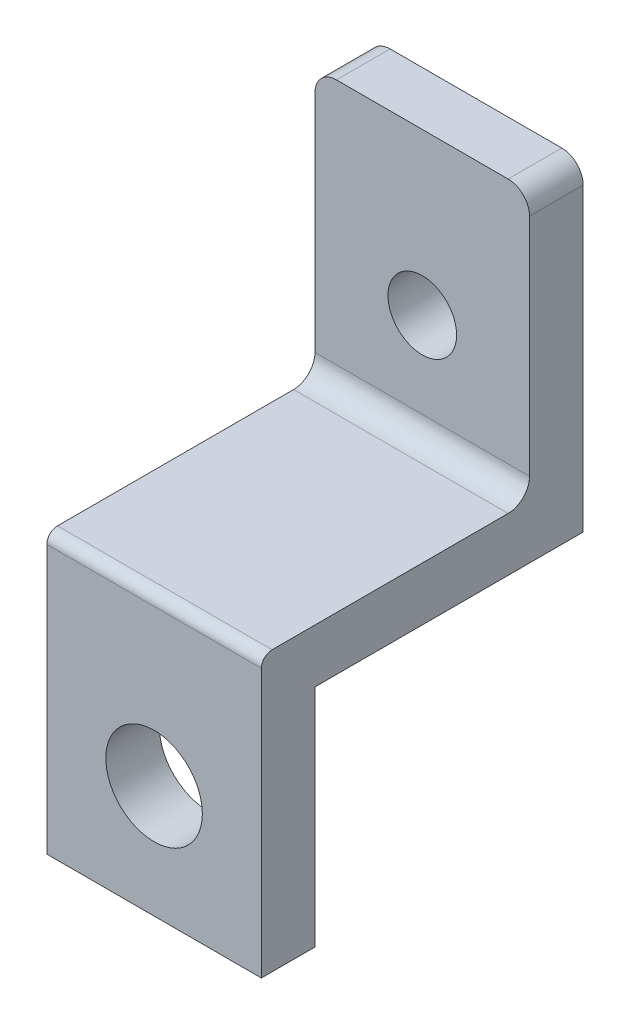
ISO-10303-21;
HEADER;
FILE_DESCRIPTION(('STEP AP214'),'2;1');
FILE_NAME('part.step','',(''),(''),'','','');
FILE_SCHEMA(('AUTOMOTIVE_DESIGN { 1 0 10303 214 1 1 1 1 }'));
ENDSEC;
DATA;
#1=APPLICATION_CONTEXT('core data for automotive mechanical design processes');
#2=APPLICATION_PROTOCOL_DEFINITION('international standard','automotive_design',2000,#1);
#3=PRODUCT_CONTEXT('',#1,'mechanical');
#4=PRODUCT('Part','Part','',(#3));
#5=PRODUCT_RELATED_PRODUCT_CATEGORY('part','',(#4));
#6=PRODUCT_DEFINITION_FORMATION('','',#4);
#7=PRODUCT_DEFINITION_CONTEXT('part definition',#1,'design');
#8=PRODUCT_DEFINITION('design','',#6,#7);
#9=PRODUCT_DEFINITION_SHAPE('','',#8);
#10=(LENGTH_UNIT() NAMED_UNIT(*) SI_UNIT(.MILLI.,.METRE.));
#11=(NAMED_UNIT(*) PLANE_ANGLE_UNIT() SI_UNIT($,.RADIAN.));
#12=(NAMED_UNIT(*) SI_UNIT($,.STERADIAN.) SOLID_ANGLE_UNIT());
#13=UNCERTAINTY_MEASURE_WITH_UNIT(LENGTH_MEASURE(1.E-05),#10,'distance_accuracy_value','');
#14=(GEOMETRIC_REPRESENTATION_CONTEXT(3) GLOBAL_UNCERTAINTY_ASSIGNED_CONTEXT((#13)) GLOBAL_UNIT_ASSIGNED_CONTEXT((#10,
#11,#12)) REPRESENTATION_CONTEXT('',''));
#15=CARTESIAN_POINT('',(0.,0.,0.));
#16=DIRECTION('',(0.,0.,1.));
#17=DIRECTION('',(1.,0.,0.));
#18=AXIS2_PLACEMENT_3D('',#15,#16,#17);
#19=CARTESIAN_POINT('',(0.,0.,0.));
#20=DIRECTION('',(0.,0.,1.));
#21=DIRECTION('',(1.,0.,0.));
#22=AXIS2_PLACEMENT_3D('',#19,#20,#21);
#23=PLANE('',#22);
#24=CARTESIAN_POINT('',(0.,-0.5,0.));
#25=DIRECTION('',(0.,0.,1.));
#26=DIRECTION('',(1.,0.,0.));
#27=AXIS2_PLACEMENT_3D('',#24,#25,#26);
#28=CIRCLE('',#27,4.5);
#29=CARTESIAN_POINT('',(4.5,-0.5,0.));
#30=VERTEX_POINT('',#29);
#31=EDGE_CURVE('E146',#30,#30,#28,.T.);
#32=ORIENTED_EDGE('',*,*,#31,.T.);
#33=EDGE_LOOP('',(#32));
#34=FACE_BOUND('',#33,.T.);
#35=DIRECTION('',(-1.,0.,0.));
#36=VECTOR('',#35,1.);
#37=CARTESIAN_POINT('',(10.,10.,0.));
#38=LINE('',#37,#36);
#39=CARTESIAN_POINT('',(10.,9.99999999999999,0.));
#40=VERTEX_POINT('',#39);
#41=CARTESIAN_POINT('',(-9.99999999999999,10.,0.));
#42=VERTEX_POINT('',#41);
#43=EDGE_CURVE('E155',#40,#42,#38,.T.);
#44=ORIENTED_EDGE('',*,*,#43,.F.);
#45=DIRECTION('',(0.,1.,0.));
#46=VECTOR('',#45,1.);
#47=CARTESIAN_POINT('',(10.,44.,0.));
#48=LINE('',#47,#46);
#49=CARTESIAN_POINT('',(10.,-11.,0.));
#50=VERTEX_POINT('',#49);
#51=EDGE_CURVE('E143',#50,#40,#48,.T.);
#52=ORIENTED_EDGE('',*,*,#51,.F.);
#53=DIRECTION('',(1.,0.,0.));
#54=VECTOR('',#53,1.);
#55=CARTESIAN_POINT('',(-10.,-11.,0.));
#56=LINE('',#55,#54);
#57=CARTESIAN_POINT('',(-10.,-11.,0.));
#58=VERTEX_POINT('',#57);
#59=EDGE_CURVE('E167',#58,#50,#56,.T.);
#60=ORIENTED_EDGE('',*,*,#59,.F.);
#61=DIRECTION('',(0.,-1.,0.));
#62=VECTOR('',#61,1.);
#63=CARTESIAN_POINT('',(-10.,-10.,0.));
#64=LINE('',#63,#62);
#65=EDGE_CURVE('E173',#42,#58,#64,.T.);
#66=ORIENTED_EDGE('',*,*,#65,.F.);
#67=EDGE_LOOP('',(#44,#52,#60,#66));
#68=FACE_BOUND('',#67,.T.);
#69=ADVANCED_FACE('F38',(#34,#68),#23,.F.);
#70=CARTESIAN_POINT('',(0.,0.,5.));
#71=DIRECTION('',(0.,0.,1.));
#72=DIRECTION('',(1.,0.,0.));
#73=AXIS2_PLACEMENT_3D('',#70,#71,#72);
#74=PLANE('',#73);
#75=DIRECTION('',(0.,1.,0.));
#76=VECTOR('',#75,1.);
#77=CARTESIAN_POINT('',(10.,-11.,5.));
#78=LINE('',#77,#76);
#79=CARTESIAN_POINT('',(10.,-11.,5.));
#80=VERTEX_POINT('',#79);
#81=CARTESIAN_POINT('',(10.,14.,5.));
#82=VERTEX_POINT('',#81);
#83=EDGE_CURVE('E163',#80,#82,#78,.T.);
#84=ORIENTED_EDGE('',*,*,#83,.T.);
#85=DIRECTION('',(1.,0.,0.));
#86=VECTOR('',#85,1.);
#87=CARTESIAN_POINT('',(-10.,14.,5.));
#88=LINE('',#87,#86);
#89=CARTESIAN_POINT('',(-10.,14.,5.));
#90=VERTEX_POINT('',#89);
#91=EDGE_CURVE('E199',#82,#90,#88,.F.);
#92=ORIENTED_EDGE('',*,*,#91,.T.);
#93=DIRECTION('',(0.,-1.,0.));
#94=VECTOR('',#93,1.);
#95=CARTESIAN_POINT('',(-10.,44.,5.));
#96=LINE('',#95,#94);
#97=CARTESIAN_POINT('',(-10.,-11.,5.));
#98=VERTEX_POINT('',#97);
#99=EDGE_CURVE('E166',#90,#98,#96,.T.);
#100=ORIENTED_EDGE('',*,*,#99,.T.);
#101=DIRECTION('',(1.,0.,0.));
#102=VECTOR('',#101,1.);
#103=CARTESIAN_POINT('',(-10.,-11.,5.));
#104=LINE('',#103,#102);
#105=EDGE_CURVE('E169',#98,#80,#104,.T.);
#106=ORIENTED_EDGE('',*,*,#105,.T.);
#107=EDGE_LOOP('',(#84,#92,#100,#106));
#108=FACE_BOUND('',#107,.T.);
#109=CARTESIAN_POINT('',(0.,-0.5,5.));
#110=DIRECTION('',(0.,0.,1.));
#111=DIRECTION('',(1.,0.,0.));
#112=AXIS2_PLACEMENT_3D('',#109,#110,#111);
#113=CIRCLE('',#112,4.5);
#114=CARTESIAN_POINT('',(4.5,-0.5,5.));
#115=VERTEX_POINT('',#114);
#116=EDGE_CURVE('E158',#115,#115,#113,.T.);
#117=ORIENTED_EDGE('',*,*,#116,.F.);
#118=EDGE_LOOP('',(#117));
#119=FACE_BOUND('',#118,.T.);
#120=ADVANCED_FACE('F262',(#108,#119),#74,.T.);
#121=CARTESIAN_POINT('',(10.,44.,5.));
#122=DIRECTION('',(-1.,0.,0.));
#123=DIRECTION('',(0.,-1.,0.));
#124=AXIS2_PLACEMENT_3D('',#121,#122,#123);
#125=PLANE('',#124);
#126=DIRECTION('',(0.,-1.,0.));
#127=VECTOR('',#126,1.);
#128=CARTESIAN_POINT('',(10.,49.,-25.));
#129=LINE('',#128,#127);
#130=CARTESIAN_POINT('',(10.,38.,-25.));
#131=VERTEX_POINT('',#130);
#132=CARTESIAN_POINT('',(10.,10.,-25.));
#133=VERTEX_POINT('',#132);
#134=EDGE_CURVE('E127',#131,#133,#129,.T.);
#135=ORIENTED_EDGE('',*,*,#134,.F.);
#136=DIRECTION('',(0.,0.,1.));
#137=VECTOR('',#136,1.);
#138=CARTESIAN_POINT('',(10.,38.,5.));
#139=LINE('',#138,#137);
#140=CARTESIAN_POINT('',(10.,38.,-20.));
#141=VERTEX_POINT('',#140);
#142=EDGE_CURVE('E11',#131,#141,#139,.T.);
#143=ORIENTED_EDGE('',*,*,#142,.T.);
#144=DIRECTION('',(0.,1.,0.));
#145=VECTOR('',#144,1.);
#146=CARTESIAN_POINT('',(10.,15.,-20.));
#147=LINE('',#146,#145);
#148=CARTESIAN_POINT('',(10.,17.,-20.));
#149=VERTEX_POINT('',#148);
#150=EDGE_CURVE('E235',#149,#141,#147,.T.);
#151=ORIENTED_EDGE('',*,*,#150,.F.);
#152=CARTESIAN_POINT('',(10.,17.,-18.));
#153=DIRECTION('',(-1.,0.,0.));
#154=DIRECTION('',(0.,-1.,0.));
#155=AXIS2_PLACEMENT_3D('',#152,#153,#154);
#156=CIRCLE('',#155,2.);
#157=CARTESIAN_POINT('',(10.,15.,-18.));
#158=VERTEX_POINT('',#157);
#159=EDGE_CURVE('E189',#149,#158,#156,.T.);
#160=ORIENTED_EDGE('',*,*,#159,.T.);
#161=DIRECTION('',(0.,0.,-1.));
#162=VECTOR('',#161,1.);
#163=CARTESIAN_POINT('',(10.,15.,0.));
#164=LINE('',#163,#162);
#165=CARTESIAN_POINT('',(10.,15.,4.));
#166=VERTEX_POINT('',#165);
#167=EDGE_CURVE('E233',#166,#158,#164,.T.);
#168=ORIENTED_EDGE('',*,*,#167,.F.);
#169=CARTESIAN_POINT('',(10.,14.,4.));
#170=DIRECTION('',(-1.,0.,0.));
#171=DIRECTION('',(0.,-1.,0.));
#172=AXIS2_PLACEMENT_3D('',#169,#170,#171);
#173=CIRCLE('',#172,1.);
#174=EDGE_CURVE('E197',#166,#82,#173,.F.);
#175=ORIENTED_EDGE('',*,*,#174,.T.);
#176=ORIENTED_EDGE('',*,*,#83,.F.);
#177=DIRECTION('',(0.,0.,-1.));
#178=VECTOR('',#177,1.);
#179=CARTESIAN_POINT('',(10.,-11.,5.));
#180=LINE('',#179,#178);
#181=EDGE_CURVE('E171',#80,#50,#180,.T.);
#182=ORIENTED_EDGE('',*,*,#181,.T.);
#183=ORIENTED_EDGE('',*,*,#51,.T.);
#184=DIRECTION('',(0.,0.,1.));
#185=VECTOR('',#184,1.);
#186=CARTESIAN_POINT('',(10.,10.,-25.));
#187=LINE('',#186,#185);
#188=EDGE_CURVE('E140',#133,#40,#187,.T.);
#189=ORIENTED_EDGE('',*,*,#188,.F.);
#190=EDGE_LOOP('',(#135,#143,#151,#160,#168,#175,#176,#182,#183,#189));
#191=FACE_BOUND('',#190,.T.);
#192=ADVANCED_FACE('F141',(#191),#125,.F.);
#193=CARTESIAN_POINT('',(-10.,-10.,5.));
#194=DIRECTION('',(1.,0.,0.));
#195=DIRECTION('',(0.,0.,-1.));
#196=AXIS2_PLACEMENT_3D('',#193,#194,#195);
#197=PLANE('',#196);
#198=DIRECTION('',(0.,1.,0.));
#199=VECTOR('',#198,1.);
#200=CARTESIAN_POINT('',(-10.,-10.,-20.));
#201=LINE('',#200,#199);
#202=CARTESIAN_POINT('',(-10.,17.,-20.));
#203=VERTEX_POINT('',#202);
#204=CARTESIAN_POINT('',(-10.,38.,-20.));
#205=VERTEX_POINT('',#204);
#206=EDGE_CURVE('E156',#203,#205,#201,.T.);
#207=ORIENTED_EDGE('',*,*,#206,.T.);
#208=DIRECTION('',(0.,0.,1.));
#209=VECTOR('',#208,1.);
#210=CARTESIAN_POINT('',(-10.,38.,5.));
#211=LINE('',#210,#209);
#212=CARTESIAN_POINT('',(-9.99999999999999,38.,-25.));
#213=VERTEX_POINT('',#212);
#214=EDGE_CURVE('E61',#205,#213,#211,.F.);
#215=ORIENTED_EDGE('',*,*,#214,.T.);
#216=DIRECTION('',(0.,1.,0.));
#217=VECTOR('',#216,1.);
#218=CARTESIAN_POINT('',(-9.99999999999999,49.,-25.));
#219=LINE('',#218,#217);
#220=CARTESIAN_POINT('',(-9.99999999999999,10.,-25.));
#221=VERTEX_POINT('',#220);
#222=EDGE_CURVE('E136',#221,#213,#219,.T.);
#223=ORIENTED_EDGE('',*,*,#222,.F.);
#224=DIRECTION('',(0.,0.,1.));
#225=VECTOR('',#224,1.);
#226=CARTESIAN_POINT('',(-9.99999999999999,10.,-25.));
#227=LINE('',#226,#225);
#228=EDGE_CURVE('E147',#221,#42,#227,.T.);
#229=ORIENTED_EDGE('',*,*,#228,.T.);
#230=ORIENTED_EDGE('',*,*,#65,.T.);
#231=DIRECTION('',(0.,0.,-1.));
#232=VECTOR('',#231,1.);
#233=CARTESIAN_POINT('',(-10.,-11.,5.));
#234=LINE('',#233,#232);
#235=EDGE_CURVE('E178',#98,#58,#234,.T.);
#236=ORIENTED_EDGE('',*,*,#235,.F.);
#237=ORIENTED_EDGE('',*,*,#99,.F.);
#238=CARTESIAN_POINT('',(-10.,14.,4.));
#239=DIRECTION('',(1.,0.,0.));
#240=DIRECTION('',(0.,0.,-1.));
#241=AXIS2_PLACEMENT_3D('',#238,#239,#240);
#242=CIRCLE('',#241,1.);
#243=CARTESIAN_POINT('',(-10.,15.,4.));
#244=VERTEX_POINT('',#243);
#245=EDGE_CURVE('E201',#90,#244,#242,.F.);
#246=ORIENTED_EDGE('',*,*,#245,.T.);
#247=DIRECTION('',(0.,0.,-1.));
#248=VECTOR('',#247,1.);
#249=CARTESIAN_POINT('',(-10.,15.,5.));
#250=LINE('',#249,#248);
#251=CARTESIAN_POINT('',(-10.,15.,-18.));
#252=VERTEX_POINT('',#251);
#253=EDGE_CURVE('E181',#244,#252,#250,.T.);
#254=ORIENTED_EDGE('',*,*,#253,.T.);
#255=CARTESIAN_POINT('',(-10.,17.,-18.));
#256=DIRECTION('',(1.,0.,0.));
#257=DIRECTION('',(0.,0.,-1.));
#258=AXIS2_PLACEMENT_3D('',#255,#256,#257);
#259=CIRCLE('',#258,2.);
#260=EDGE_CURVE('E192',#252,#203,#259,.T.);
#261=ORIENTED_EDGE('',*,*,#260,.T.);
#262=EDGE_LOOP('',(#207,#215,#223,#229,#230,#236,#237,#246,#254,#261));
#263=FACE_BOUND('',#262,.T.);
#264=ADVANCED_FACE('F231',(#263),#197,.F.);
#265=CARTESIAN_POINT('',(-10.,-11.,5.));
#266=DIRECTION('',(0.,1.,0.));
#267=DIRECTION('',(0.,0.,1.));
#268=AXIS2_PLACEMENT_3D('',#265,#266,#267);
#269=PLANE('',#268);
#270=ORIENTED_EDGE('',*,*,#59,.T.);
#271=ORIENTED_EDGE('',*,*,#181,.F.);
#272=ORIENTED_EDGE('',*,*,#105,.F.);
#273=ORIENTED_EDGE('',*,*,#235,.T.);
#274=EDGE_LOOP('',(#270,#271,#272,#273));
#275=FACE_BOUND('',#274,.T.);
#276=ADVANCED_FACE('F269',(#275),#269,.F.);
#277=CARTESIAN_POINT('',(0.,-0.5,5.));
#278=DIRECTION('',(0.,0.,-1.));
#279=DIRECTION('',(-1.,0.,0.));
#280=AXIS2_PLACEMENT_3D('',#277,#278,#279);
#281=CYLINDRICAL_SURFACE('',#280,4.5);
#282=ORIENTED_EDGE('',*,*,#116,.T.);
#283=EDGE_LOOP('',(#282));
#284=FACE_BOUND('',#283,.T.);
#285=ORIENTED_EDGE('',*,*,#31,.F.);
#286=EDGE_LOOP('',(#285));
#287=FACE_BOUND('',#286,.T.);
#288=ADVANCED_FACE('F282',(#284,#287),#281,.F.);
#289=CARTESIAN_POINT('',(10.,10.,-25.));
#290=DIRECTION('',(0.,1.,0.));
#291=DIRECTION('',(0.,0.,1.));
#292=AXIS2_PLACEMENT_3D('',#289,#290,#291);
#293=PLANE('',#292);
#294=ORIENTED_EDGE('',*,*,#43,.T.);
#295=ORIENTED_EDGE('',*,*,#228,.F.);
#296=DIRECTION('',(-1.,0.,0.));
#297=VECTOR('',#296,1.);
#298=CARTESIAN_POINT('',(10.,10.,-25.));
#299=LINE('',#298,#297);
#300=EDGE_CURVE('E132',#133,#221,#299,.T.);
#301=ORIENTED_EDGE('',*,*,#300,.F.);
#302=ORIENTED_EDGE('',*,*,#188,.T.);
#303=EDGE_LOOP('',(#294,#295,#301,#302));
#304=FACE_BOUND('',#303,.T.);
#305=ADVANCED_FACE('F149',(#304),#293,.F.);
#306=CARTESIAN_POINT('',(0.,0.,-25.));
#307=DIRECTION('',(0.,0.,-1.));
#308=DIRECTION('',(-1.,0.,0.));
#309=AXIS2_PLACEMENT_3D('',#306,#307,#308);
#310=PLANE('',#309);
#311=ORIENTED_EDGE('',*,*,#222,.T.);
#312=CARTESIAN_POINT('',(-8.,38.,-25.));
#313=DIRECTION('',(0.,0.,-1.));
#314=DIRECTION('',(-1.,0.,0.));
#315=AXIS2_PLACEMENT_3D('',#312,#313,#314);
#316=CIRCLE('',#315,2.);
#317=CARTESIAN_POINT('',(-8.,40.,-25.));
#318=VERTEX_POINT('',#317);
#319=EDGE_CURVE('E46',#213,#318,#316,.T.);
#320=ORIENTED_EDGE('',*,*,#319,.T.);
#321=DIRECTION('',(-1.,0.,0.));
#322=VECTOR('',#321,1.);
#323=CARTESIAN_POINT('',(0.,40.,-25.));
#324=LINE('',#323,#322);
#325=CARTESIAN_POINT('',(8.00000000000001,40.,-25.));
#326=VERTEX_POINT('',#325);
#327=EDGE_CURVE('E215',#326,#318,#324,.T.);
#328=ORIENTED_EDGE('',*,*,#327,.F.);
#329=CARTESIAN_POINT('',(8.00000000000001,38.,-25.));
#330=DIRECTION('',(0.,0.,-1.));
#331=DIRECTION('',(-1.,0.,0.));
#332=AXIS2_PLACEMENT_3D('',#329,#330,#331);
#333=CIRCLE('',#332,2.);
#334=EDGE_CURVE('E53',#326,#131,#333,.T.);
#335=ORIENTED_EDGE('',*,*,#334,.T.);
#336=ORIENTED_EDGE('',*,*,#134,.T.);
#337=ORIENTED_EDGE('',*,*,#300,.T.);
#338=EDGE_LOOP('',(#311,#320,#328,#335,#336,#337));
#339=FACE_BOUND('',#338,.T.);
#340=CARTESIAN_POINT('',(0.,25.,-25.));
#341=DIRECTION('',(0.,0.,-1.));
#342=DIRECTION('',(-1.,0.,0.));
#343=AXIS2_PLACEMENT_3D('',#340,#341,#342);
#344=CIRCLE('',#343,3.2);
#345=CARTESIAN_POINT('',(-3.2,25.,-25.));
#346=VERTEX_POINT('',#345);
#347=EDGE_CURVE('E240',#346,#346,#344,.T.);
#348=ORIENTED_EDGE('',*,*,#347,.F.);
#349=EDGE_LOOP('',(#348));
#350=FACE_BOUND('',#349,.T.);
#351=ADVANCED_FACE('F129',(#339,#350),#310,.T.);
#352=CARTESIAN_POINT('',(-20.,15.,0.));
#353=DIRECTION('',(0.,-1.,0.));
#354=DIRECTION('',(1.,0.,0.));
#355=AXIS2_PLACEMENT_3D('',#352,#353,#354);
#356=PLANE('',#355);
#357=ORIENTED_EDGE('',*,*,#253,.F.);
#358=DIRECTION('',(1.,0.,0.));
#359=VECTOR('',#358,1.);
#360=CARTESIAN_POINT('',(9.99999999999999,15.,4.));
#361=LINE('',#360,#359);
#362=EDGE_CURVE('E194',#244,#166,#361,.T.);
#363=ORIENTED_EDGE('',*,*,#362,.T.);
#364=ORIENTED_EDGE('',*,*,#167,.T.);
#365=DIRECTION('',(1.,0.,0.));
#366=VECTOR('',#365,1.);
#367=CARTESIAN_POINT('',(-10.,15.,-18.));
#368=LINE('',#367,#366);
#369=EDGE_CURVE('E186',#158,#252,#368,.F.);
#370=ORIENTED_EDGE('',*,*,#369,.T.);
#371=EDGE_LOOP('',(#357,#363,#364,#370));
#372=FACE_BOUND('',#371,.T.);
#373=ADVANCED_FACE('F254',(#372),#356,.F.);
#374=CARTESIAN_POINT('',(-20.,15.,-20.));
#375=DIRECTION('',(0.,0.,-1.));
#376=DIRECTION('',(-1.,0.,0.));
#377=AXIS2_PLACEMENT_3D('',#374,#375,#376);
#378=PLANE('',#377);
#379=CARTESIAN_POINT('',(0.,25.,-20.));
#380=DIRECTION('',(0.,0.,1.));
#381=DIRECTION('',(1.,0.,0.));
#382=AXIS2_PLACEMENT_3D('',#379,#380,#381);
#383=CIRCLE('',#382,3.2);
#384=CARTESIAN_POINT('',(3.2,25.,-20.));
#385=VERTEX_POINT('',#384);
#386=EDGE_CURVE('E223',#385,#385,#383,.T.);
#387=ORIENTED_EDGE('',*,*,#386,.F.);
#388=EDGE_LOOP('',(#387));
#389=FACE_BOUND('',#388,.T.);
#390=DIRECTION('',(1.,0.,0.));
#391=VECTOR('',#390,1.);
#392=CARTESIAN_POINT('',(-10.,40.,-20.));
#393=LINE('',#392,#391);
#394=CARTESIAN_POINT('',(-8.,40.,-20.));
#395=VERTEX_POINT('',#394);
#396=CARTESIAN_POINT('',(8.00000000000001,40.,-20.));
#397=VERTEX_POINT('',#396);
#398=EDGE_CURVE('E224',#395,#397,#393,.T.);
#399=ORIENTED_EDGE('',*,*,#398,.F.);
#400=CARTESIAN_POINT('',(-8.,38.,-20.));
#401=DIRECTION('',(0.,0.,-1.));
#402=DIRECTION('',(-1.,0.,0.));
#403=AXIS2_PLACEMENT_3D('',#400,#401,#402);
#404=CIRCLE('',#403,2.);
#405=EDGE_CURVE('E210',#395,#205,#404,.F.);
#406=ORIENTED_EDGE('',*,*,#405,.T.);
#407=ORIENTED_EDGE('',*,*,#206,.F.);
#408=DIRECTION('',(1.,0.,0.));
#409=VECTOR('',#408,1.);
#410=CARTESIAN_POINT('',(9.99999999999999,17.,-20.));
#411=LINE('',#410,#409);
#412=EDGE_CURVE('E183',#203,#149,#411,.T.);
#413=ORIENTED_EDGE('',*,*,#412,.T.);
#414=ORIENTED_EDGE('',*,*,#150,.T.);
#415=CARTESIAN_POINT('',(8.00000000000001,38.,-20.));
#416=DIRECTION('',(0.,0.,-1.));
#417=DIRECTION('',(-1.,0.,0.));
#418=AXIS2_PLACEMENT_3D('',#415,#416,#417);
#419=CIRCLE('',#418,2.);
#420=EDGE_CURVE('E208',#141,#397,#419,.F.);
#421=ORIENTED_EDGE('',*,*,#420,.T.);
#422=EDGE_LOOP('',(#399,#406,#407,#413,#414,#421));
#423=FACE_BOUND('',#422,.T.);
#424=ADVANCED_FACE('F229',(#389,#423),#378,.F.);
#425=CARTESIAN_POINT('',(0.,25.,-30.));
#426=DIRECTION('',(0.,0.,1.));
#427=DIRECTION('',(1.,0.,0.));
#428=AXIS2_PLACEMENT_3D('',#425,#426,#427);
#429=CYLINDRICAL_SURFACE('',#428,3.2);
#430=ORIENTED_EDGE('',*,*,#347,.T.);
#431=EDGE_LOOP('',(#430));
#432=FACE_BOUND('',#431,.T.);
#433=ORIENTED_EDGE('',*,*,#386,.T.);
#434=EDGE_LOOP('',(#433));
#435=FACE_BOUND('',#434,.T.);
#436=ADVANCED_FACE('F289',(#432,#435),#429,.F.);
#437=CARTESIAN_POINT('',(-20.,17.,-18.));
#438=DIRECTION('',(-1.,0.,0.));
#439=DIRECTION('',(0.,-1.,0.));
#440=AXIS2_PLACEMENT_3D('',#437,#438,#439);
#441=CYLINDRICAL_SURFACE('',#440,2.);
#442=ORIENTED_EDGE('',*,*,#260,.F.);
#443=ORIENTED_EDGE('',*,*,#369,.F.);
#444=ORIENTED_EDGE('',*,*,#159,.F.);
#445=ORIENTED_EDGE('',*,*,#412,.F.);
#446=EDGE_LOOP('',(#442,#443,#444,#445));
#447=FACE_BOUND('',#446,.T.);
#448=ADVANCED_FACE('F248',(#447),#441,.F.);
#449=CARTESIAN_POINT('',(-20.,14.,4.));
#450=DIRECTION('',(-1.,0.,0.));
#451=DIRECTION('',(0.,-1.,0.));
#452=AXIS2_PLACEMENT_3D('',#449,#450,#451);
#453=CYLINDRICAL_SURFACE('',#452,1.);
#454=ORIENTED_EDGE('',*,*,#245,.F.);
#455=ORIENTED_EDGE('',*,*,#91,.F.);
#456=ORIENTED_EDGE('',*,*,#174,.F.);
#457=ORIENTED_EDGE('',*,*,#362,.F.);
#458=EDGE_LOOP('',(#454,#455,#456,#457));
#459=FACE_BOUND('',#458,.T.);
#460=ADVANCED_FACE('F258',(#459),#453,.T.);
#461=CARTESIAN_POINT('',(-10.,40.,-30.));
#462=DIRECTION('',(0.,-1.,0.));
#463=DIRECTION('',(0.,0.,-1.));
#464=AXIS2_PLACEMENT_3D('',#461,#462,#463);
#465=PLANE('',#464);
#466=ORIENTED_EDGE('',*,*,#327,.T.);
#467=DIRECTION('',(0.,0.,1.));
#468=VECTOR('',#467,1.);
#469=CARTESIAN_POINT('',(-8.,40.,-30.));
#470=LINE('',#469,#468);
#471=EDGE_CURVE('E205',#318,#395,#470,.T.);
#472=ORIENTED_EDGE('',*,*,#471,.T.);
#473=ORIENTED_EDGE('',*,*,#398,.T.);
#474=DIRECTION('',(0.,0.,1.));
#475=VECTOR('',#474,1.);
#476=CARTESIAN_POINT('',(8.00000000000001,40.,-30.));
#477=LINE('',#476,#475);
#478=EDGE_CURVE('E203',#397,#326,#477,.F.);
#479=ORIENTED_EDGE('',*,*,#478,.T.);
#480=EDGE_LOOP('',(#466,#472,#473,#479));
#481=FACE_BOUND('',#480,.T.);
#482=ADVANCED_FACE('F219',(#481),#465,.F.);
#483=CARTESIAN_POINT('',(-8.,38.,-30.));
#484=DIRECTION('',(0.,0.,1.));
#485=DIRECTION('',(1.,0.,0.));
#486=AXIS2_PLACEMENT_3D('',#483,#484,#485);
#487=CYLINDRICAL_SURFACE('',#486,2.);
#488=ORIENTED_EDGE('',*,*,#319,.F.);
#489=ORIENTED_EDGE('',*,*,#214,.F.);
#490=ORIENTED_EDGE('',*,*,#405,.F.);
#491=ORIENTED_EDGE('',*,*,#471,.F.);
#492=EDGE_LOOP('',(#488,#489,#490,#491));
#493=FACE_BOUND('',#492,.T.);
#494=ADVANCED_FACE('F226',(#493),#487,.T.);
#495=CARTESIAN_POINT('',(8.00000000000001,38.,5.));
#496=DIRECTION('',(0.,0.,1.));
#497=DIRECTION('',(1.,0.,0.));
#498=AXIS2_PLACEMENT_3D('',#495,#496,#497);
#499=CYLINDRICAL_SURFACE('',#498,2.);
#500=ORIENTED_EDGE('',*,*,#334,.F.);
#501=ORIENTED_EDGE('',*,*,#478,.F.);
#502=ORIENTED_EDGE('',*,*,#420,.F.);
#503=ORIENTED_EDGE('',*,*,#142,.F.);
#504=EDGE_LOOP('',(#500,#501,#502,#503));
#505=FACE_BOUND('',#504,.T.);
#506=ADVANCED_FACE('F40',(#505),#499,.T.);
#507=CLOSED_SHELL('',(#69,#120,#192,#264,#276,#288,#305,#351,#373,#424,#436,#448,#460,#482,#494,#506));
#508=MANIFOLD_SOLID_BREP('B2',#507);
#509=ADVANCED_BREP_SHAPE_REPRESENTATION('',(#18,#508),#14);
#510=SHAPE_DEFINITION_REPRESENTATION(#9,#509);
ENDSEC;
END-ISO-10303-21;
